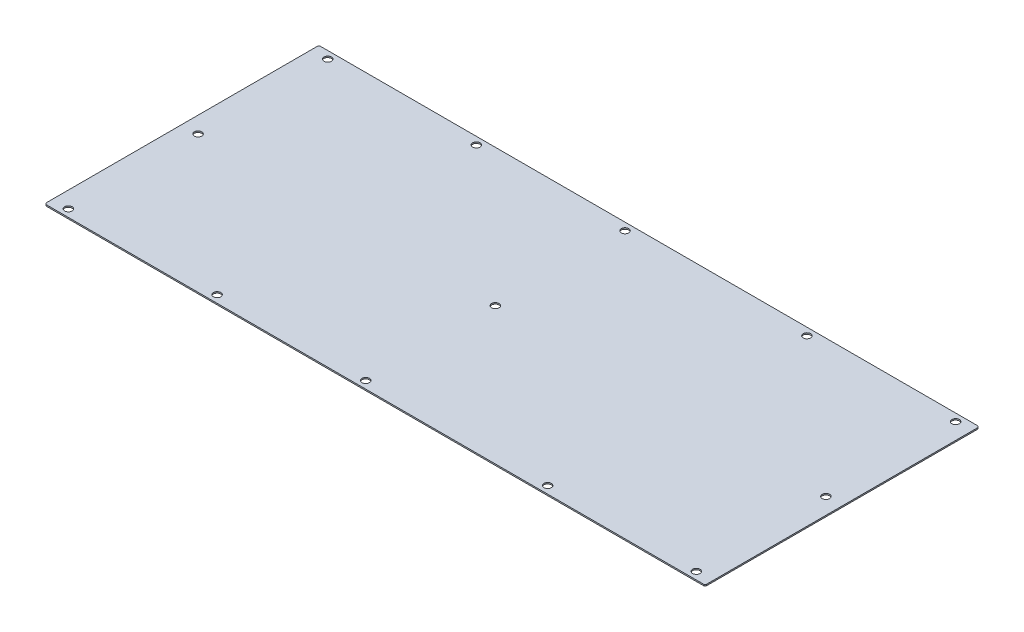
ISO-10303-21;
HEADER;
FILE_DESCRIPTION(('STEP AP214'),'2;1');
FILE_NAME('part.step','',(''),(''),'','','');
FILE_SCHEMA(('AUTOMOTIVE_DESIGN { 1 0 10303 214 1 1 1 1 }'));
ENDSEC;
DATA;
#1=APPLICATION_CONTEXT('core data for automotive mechanical design processes');
#2=APPLICATION_PROTOCOL_DEFINITION('international standard','automotive_design',2000,#1);
#3=PRODUCT_CONTEXT('',#1,'mechanical');
#4=PRODUCT('Part','Part','',(#3));
#5=PRODUCT_RELATED_PRODUCT_CATEGORY('part','',(#4));
#6=PRODUCT_DEFINITION_FORMATION('','',#4);
#7=PRODUCT_DEFINITION_CONTEXT('part definition',#1,'design');
#8=PRODUCT_DEFINITION('design','',#6,#7);
#9=PRODUCT_DEFINITION_SHAPE('','',#8);
#10=(LENGTH_UNIT() NAMED_UNIT(*) SI_UNIT(.MILLI.,.METRE.));
#11=(NAMED_UNIT(*) PLANE_ANGLE_UNIT() SI_UNIT($,.RADIAN.));
#12=(NAMED_UNIT(*) SI_UNIT($,.STERADIAN.) SOLID_ANGLE_UNIT());
#13=UNCERTAINTY_MEASURE_WITH_UNIT(LENGTH_MEASURE(1.E-05),#10,'distance_accuracy_value','');
#14=(GEOMETRIC_REPRESENTATION_CONTEXT(3) GLOBAL_UNCERTAINTY_ASSIGNED_CONTEXT((#13)) GLOBAL_UNIT_ASSIGNED_CONTEXT((#10,
#11,#12)) REPRESENTATION_CONTEXT('',''));
#15=CARTESIAN_POINT('',(0.,0.,0.));
#16=DIRECTION('',(0.,0.,1.));
#17=DIRECTION('',(1.,0.,0.));
#18=AXIS2_PLACEMENT_3D('',#15,#16,#17);
#19=CARTESIAN_POINT('',(0.,-1.,0.));
#20=DIRECTION('',(0.,1.,0.));
#21=DIRECTION('',(0.,0.,1.));
#22=AXIS2_PLACEMENT_3D('',#19,#20,#21);
#23=PLANE('',#22);
#24=DIRECTION('',(0.707106781186548,0.,0.707106781186548));
#25=VECTOR('',#24,1.);
#26=CARTESIAN_POINT('',(243.25,-1.,-100.));
#27=LINE('',#26,#25);
#28=CARTESIAN_POINT('',(242.25,-1.,-101.));
#29=VERTEX_POINT('',#28);
#30=CARTESIAN_POINT('',(243.25,-1.,-100.));
#31=VERTEX_POINT('',#30);
#32=EDGE_CURVE('E80',#29,#31,#27,.T.);
#33=ORIENTED_EDGE('',*,*,#32,.T.);
#34=DIRECTION('',(0.,0.,-1.));
#35=VECTOR('',#34,1.);
#36=CARTESIAN_POINT('',(243.25,-1.,-101.));
#37=LINE('',#36,#35);
#38=CARTESIAN_POINT('',(243.25,-1.,100.));
#39=VERTEX_POINT('',#38);
#40=EDGE_CURVE('E86',#39,#31,#37,.T.);
#41=ORIENTED_EDGE('',*,*,#40,.F.);
#42=DIRECTION('',(0.707106781186538,0.,-0.707106781186557));
#43=VECTOR('',#42,1.);
#44=CARTESIAN_POINT('',(242.25,-1.,101.));
#45=LINE('',#44,#43);
#46=CARTESIAN_POINT('',(242.25,-1.,101.));
#47=VERTEX_POINT('',#46);
#48=EDGE_CURVE('E108',#47,#39,#45,.T.);
#49=ORIENTED_EDGE('',*,*,#48,.F.);
#50=DIRECTION('',(1.,0.,0.));
#51=VECTOR('',#50,1.);
#52=CARTESIAN_POINT('',(-243.25,-1.,101.));
#53=LINE('',#52,#51);
#54=CARTESIAN_POINT('',(-242.25,-1.,101.));
#55=VERTEX_POINT('',#54);
#56=EDGE_CURVE('E504',#55,#47,#53,.T.);
#57=ORIENTED_EDGE('',*,*,#56,.F.);
#58=DIRECTION('',(-0.707106781186548,0.,-0.707106781186548));
#59=VECTOR('',#58,1.);
#60=CARTESIAN_POINT('',(-243.25,-1.,100.));
#61=LINE('',#60,#59);
#62=CARTESIAN_POINT('',(-243.25,-1.,100.));
#63=VERTEX_POINT('',#62);
#64=EDGE_CURVE('E502',#55,#63,#61,.T.);
#65=ORIENTED_EDGE('',*,*,#64,.T.);
#66=DIRECTION('',(0.,0.,1.));
#67=VECTOR('',#66,1.);
#68=CARTESIAN_POINT('',(-243.25,-1.,-101.));
#69=LINE('',#68,#67);
#70=CARTESIAN_POINT('',(-243.25,-1.,-99.9999999999999));
#71=VERTEX_POINT('',#70);
#72=EDGE_CURVE('E489',#71,#63,#69,.T.);
#73=ORIENTED_EDGE('',*,*,#72,.F.);
#74=DIRECTION('',(0.707106781186548,0.,-0.707106781186548));
#75=VECTOR('',#74,1.);
#76=CARTESIAN_POINT('',(-242.25,-1.,-101.));
#77=LINE('',#76,#75);
#78=CARTESIAN_POINT('',(-242.25,-1.,-101.));
#79=VERTEX_POINT('',#78);
#80=EDGE_CURVE('E487',#71,#79,#77,.T.);
#81=ORIENTED_EDGE('',*,*,#80,.T.);
#82=DIRECTION('',(-1.,0.,0.));
#83=VECTOR('',#82,1.);
#84=CARTESIAN_POINT('',(-243.25,-1.,-101.));
#85=LINE('',#84,#83);
#86=EDGE_CURVE('E97',#29,#79,#85,.T.);
#87=ORIENTED_EDGE('',*,*,#86,.F.);
#88=EDGE_LOOP('',(#33,#41,#49,#57,#65,#73,#81,#87));
#89=FACE_BOUND('',#88,.T.);
#90=CARTESIAN_POINT('',(-231.25,-0.999999999999999,-95.5));
#91=DIRECTION('',(0.,1.,0.));
#92=DIRECTION('',(0.,0.,1.));
#93=AXIS2_PLACEMENT_3D('',#90,#91,#92);
#94=CIRCLE('',#93,2.75);
#95=CARTESIAN_POINT('',(-231.25,-0.999999999999999,-92.75));
#96=VERTEX_POINT('',#95);
#97=EDGE_CURVE('E93',#96,#96,#94,.T.);
#98=ORIENTED_EDGE('',*,*,#97,.T.);
#99=EDGE_LOOP('',(#98));
#100=FACE_BOUND('',#99,.T.);
#101=CARTESIAN_POINT('',(-121.75,-0.999999999999999,-95.5));
#102=DIRECTION('',(0.,1.,0.));
#103=DIRECTION('',(0.,0.,1.));
#104=AXIS2_PLACEMENT_3D('',#101,#102,#103);
#105=CIRCLE('',#104,2.75);
#106=CARTESIAN_POINT('',(-121.75,-0.999999999999999,-92.75));
#107=VERTEX_POINT('',#106);
#108=EDGE_CURVE('E152',#107,#107,#105,.T.);
#109=ORIENTED_EDGE('',*,*,#108,.T.);
#110=EDGE_LOOP('',(#109));
#111=FACE_BOUND('',#110,.T.);
#112=CARTESIAN_POINT('',(121.75,-0.999999999999999,-95.5));
#113=DIRECTION('',(0.,1.,0.));
#114=DIRECTION('',(0.,0.,1.));
#115=AXIS2_PLACEMENT_3D('',#112,#113,#114);
#116=CIRCLE('',#115,2.75000000000002);
#117=CARTESIAN_POINT('',(121.75,-0.999999999999999,-92.75));
#118=VERTEX_POINT('',#117);
#119=EDGE_CURVE('E155',#118,#118,#116,.T.);
#120=ORIENTED_EDGE('',*,*,#119,.T.);
#121=EDGE_LOOP('',(#120));
#122=FACE_BOUND('',#121,.T.);
#123=CARTESIAN_POINT('',(-121.75,-0.999999999999999,95.5));
#124=DIRECTION('',(0.,1.,0.));
#125=DIRECTION('',(0.,0.,1.));
#126=AXIS2_PLACEMENT_3D('',#123,#124,#125);
#127=CIRCLE('',#126,2.75);
#128=CARTESIAN_POINT('',(-121.75,-0.999999999999999,98.25));
#129=VERTEX_POINT('',#128);
#130=EDGE_CURVE('E158',#129,#129,#127,.T.);
#131=ORIENTED_EDGE('',*,*,#130,.T.);
#132=EDGE_LOOP('',(#131));
#133=FACE_BOUND('',#132,.T.);
#134=CARTESIAN_POINT('',(231.25,-0.999999999999999,-95.5));
#135=DIRECTION('',(0.,1.,0.));
#136=DIRECTION('',(0.,0.,1.));
#137=AXIS2_PLACEMENT_3D('',#134,#135,#136);
#138=CIRCLE('',#137,2.75);
#139=CARTESIAN_POINT('',(231.25,-0.999999999999999,-92.75));
#140=VERTEX_POINT('',#139);
#141=EDGE_CURVE('E161',#140,#140,#138,.T.);
#142=ORIENTED_EDGE('',*,*,#141,.T.);
#143=EDGE_LOOP('',(#142));
#144=FACE_BOUND('',#143,.T.);
#145=CARTESIAN_POINT('',(231.25,-0.999999999999999,95.5));
#146=DIRECTION('',(0.,1.,0.));
#147=DIRECTION('',(0.,0.,1.));
#148=AXIS2_PLACEMENT_3D('',#145,#146,#147);
#149=CIRCLE('',#148,2.75);
#150=CARTESIAN_POINT('',(231.25,-0.999999999999999,98.25));
#151=VERTEX_POINT('',#150);
#152=EDGE_CURVE('E164',#151,#151,#149,.T.);
#153=ORIENTED_EDGE('',*,*,#152,.T.);
#154=EDGE_LOOP('',(#153));
#155=FACE_BOUND('',#154,.T.);
#156=CARTESIAN_POINT('',(-231.25,-0.999999999999999,95.5));
#157=DIRECTION('',(0.,1.,0.));
#158=DIRECTION('',(0.,0.,1.));
#159=AXIS2_PLACEMENT_3D('',#156,#157,#158);
#160=CIRCLE('',#159,2.75);
#161=CARTESIAN_POINT('',(-231.25,-0.999999999999999,98.25));
#162=VERTEX_POINT('',#161);
#163=EDGE_CURVE('E167',#162,#162,#160,.T.);
#164=ORIENTED_EDGE('',*,*,#163,.T.);
#165=EDGE_LOOP('',(#164));
#166=FACE_BOUND('',#165,.T.);
#167=CARTESIAN_POINT('',(-231.25,-0.999999999999999,0.));
#168=DIRECTION('',(0.,1.,0.));
#169=DIRECTION('',(0.,0.,1.));
#170=AXIS2_PLACEMENT_3D('',#167,#168,#169);
#171=CIRCLE('',#170,2.75000000000001);
#172=CARTESIAN_POINT('',(-231.25,-0.999999999999999,2.75000000000001));
#173=VERTEX_POINT('',#172);
#174=EDGE_CURVE('E170',#173,#173,#171,.T.);
#175=ORIENTED_EDGE('',*,*,#174,.T.);
#176=EDGE_LOOP('',(#175));
#177=FACE_BOUND('',#176,.T.);
#178=CARTESIAN_POINT('',(231.25,-0.999999999999999,0.));
#179=DIRECTION('',(0.,1.,0.));
#180=DIRECTION('',(0.,0.,1.));
#181=AXIS2_PLACEMENT_3D('',#178,#179,#180);
#182=CIRCLE('',#181,2.75000000000001);
#183=CARTESIAN_POINT('',(231.25,-0.999999999999999,2.75000000000001));
#184=VERTEX_POINT('',#183);
#185=EDGE_CURVE('E173',#184,#184,#182,.T.);
#186=ORIENTED_EDGE('',*,*,#185,.T.);
#187=EDGE_LOOP('',(#186));
#188=FACE_BOUND('',#187,.T.);
#189=CARTESIAN_POINT('',(-12.25,-0.999999999999999,95.5));
#190=DIRECTION('',(0.,1.,0.));
#191=DIRECTION('',(0.,0.,1.));
#192=AXIS2_PLACEMENT_3D('',#189,#190,#191);
#193=CIRCLE('',#192,2.75);
#194=CARTESIAN_POINT('',(-12.25,-0.999999999999999,98.25));
#195=VERTEX_POINT('',#194);
#196=EDGE_CURVE('E176',#195,#195,#193,.T.);
#197=ORIENTED_EDGE('',*,*,#196,.T.);
#198=EDGE_LOOP('',(#197));
#199=FACE_BOUND('',#198,.T.);
#200=CARTESIAN_POINT('',(-12.25,-0.999999999999999,0.));
#201=DIRECTION('',(0.,1.,0.));
#202=DIRECTION('',(0.,0.,1.));
#203=AXIS2_PLACEMENT_3D('',#200,#201,#202);
#204=CIRCLE('',#203,2.75);
#205=CARTESIAN_POINT('',(-12.25,-0.999999999999999,2.75));
#206=VERTEX_POINT('',#205);
#207=EDGE_CURVE('E179',#206,#206,#204,.T.);
#208=ORIENTED_EDGE('',*,*,#207,.T.);
#209=EDGE_LOOP('',(#208));
#210=FACE_BOUND('',#209,.T.);
#211=CARTESIAN_POINT('',(-12.25,-0.999999999999999,-95.5));
#212=DIRECTION('',(0.,1.,0.));
#213=DIRECTION('',(0.,0.,1.));
#214=AXIS2_PLACEMENT_3D('',#211,#212,#213);
#215=CIRCLE('',#214,2.75);
#216=CARTESIAN_POINT('',(-12.25,-0.999999999999999,-92.75));
#217=VERTEX_POINT('',#216);
#218=EDGE_CURVE('E181',#217,#217,#215,.T.);
#219=ORIENTED_EDGE('',*,*,#218,.T.);
#220=EDGE_LOOP('',(#219));
#221=FACE_BOUND('',#220,.T.);
#222=CARTESIAN_POINT('',(121.75,-0.999999999999999,95.5));
#223=DIRECTION('',(0.,1.,0.));
#224=DIRECTION('',(0.,0.,1.));
#225=AXIS2_PLACEMENT_3D('',#222,#223,#224);
#226=CIRCLE('',#225,2.75000000000002);
#227=CARTESIAN_POINT('',(121.75,-0.999999999999999,98.25));
#228=VERTEX_POINT('',#227);
#229=EDGE_CURVE('E20',#228,#228,#226,.T.);
#230=ORIENTED_EDGE('',*,*,#229,.T.);
#231=EDGE_LOOP('',(#230));
#232=FACE_BOUND('',#231,.T.);
#233=ADVANCED_FACE('F17',(#89,#100,#111,#122,#133,#144,#155,#166,#177,#188,#199,#210,#221,#232),
#23,.F.);
#234=CARTESIAN_POINT('',(121.75,-10.,95.5));
#235=DIRECTION('',(0.,1.,0.));
#236=DIRECTION('',(0.,0.,1.));
#237=AXIS2_PLACEMENT_3D('',#234,#235,#236);
#238=CYLINDRICAL_SURFACE('',#237,2.75000000000002);
#239=CARTESIAN_POINT('',(121.75,0.,95.5));
#240=DIRECTION('',(0.,1.,0.));
#241=DIRECTION('',(0.,0.,1.));
#242=AXIS2_PLACEMENT_3D('',#239,#240,#241);
#243=CIRCLE('',#242,2.75000000000002);
#244=CARTESIAN_POINT('',(121.75,0.,98.25));
#245=VERTEX_POINT('',#244);
#246=EDGE_CURVE('E147',#245,#245,#243,.F.);
#247=ORIENTED_EDGE('',*,*,#246,.F.);
#248=EDGE_LOOP('',(#247));
#249=FACE_BOUND('',#248,.T.);
#250=ORIENTED_EDGE('',*,*,#229,.F.);
#251=EDGE_LOOP('',(#250));
#252=FACE_BOUND('',#251,.T.);
#253=ADVANCED_FACE('F189',(#249,#252),#238,.F.);
#254=CARTESIAN_POINT('',(-12.25,-10.,-95.5));
#255=DIRECTION('',(0.,1.,0.));
#256=DIRECTION('',(0.,0.,1.));
#257=AXIS2_PLACEMENT_3D('',#254,#255,#256);
#258=CYLINDRICAL_SURFACE('',#257,2.75);
#259=CARTESIAN_POINT('',(-12.25,0.,-95.5));
#260=DIRECTION('',(0.,1.,0.));
#261=DIRECTION('',(0.,0.,1.));
#262=AXIS2_PLACEMENT_3D('',#259,#260,#261);
#263=CIRCLE('',#262,2.75);
#264=CARTESIAN_POINT('',(-12.25,0.,-92.75));
#265=VERTEX_POINT('',#264);
#266=EDGE_CURVE('E144',#265,#265,#263,.F.);
#267=ORIENTED_EDGE('',*,*,#266,.F.);
#268=EDGE_LOOP('',(#267));
#269=FACE_BOUND('',#268,.T.);
#270=ORIENTED_EDGE('',*,*,#218,.F.);
#271=EDGE_LOOP('',(#270));
#272=FACE_BOUND('',#271,.T.);
#273=ADVANCED_FACE('F191',(#269,#272),#258,.F.);
#274=CARTESIAN_POINT('',(-12.25,-10.,0.));
#275=DIRECTION('',(0.,1.,0.));
#276=DIRECTION('',(0.,0.,1.));
#277=AXIS2_PLACEMENT_3D('',#274,#275,#276);
#278=CYLINDRICAL_SURFACE('',#277,2.75);
#279=CARTESIAN_POINT('',(-12.25,0.,0.));
#280=DIRECTION('',(0.,1.,0.));
#281=DIRECTION('',(0.,0.,1.));
#282=AXIS2_PLACEMENT_3D('',#279,#280,#281);
#283=CIRCLE('',#282,2.75);
#284=CARTESIAN_POINT('',(-12.25,0.,2.75));
#285=VERTEX_POINT('',#284);
#286=EDGE_CURVE('E141',#285,#285,#283,.F.);
#287=ORIENTED_EDGE('',*,*,#286,.F.);
#288=EDGE_LOOP('',(#287));
#289=FACE_BOUND('',#288,.T.);
#290=ORIENTED_EDGE('',*,*,#207,.F.);
#291=EDGE_LOOP('',(#290));
#292=FACE_BOUND('',#291,.T.);
#293=ADVANCED_FACE('F198',(#289,#292),#278,.F.);
#294=CARTESIAN_POINT('',(-12.25,-10.,95.5));
#295=DIRECTION('',(0.,1.,0.));
#296=DIRECTION('',(0.,0.,1.));
#297=AXIS2_PLACEMENT_3D('',#294,#295,#296);
#298=CYLINDRICAL_SURFACE('',#297,2.75);
#299=CARTESIAN_POINT('',(-12.25,0.,95.5));
#300=DIRECTION('',(0.,1.,0.));
#301=DIRECTION('',(0.,0.,1.));
#302=AXIS2_PLACEMENT_3D('',#299,#300,#301);
#303=CIRCLE('',#302,2.75);
#304=CARTESIAN_POINT('',(-12.25,0.,98.25));
#305=VERTEX_POINT('',#304);
#306=EDGE_CURVE('E138',#305,#305,#303,.F.);
#307=ORIENTED_EDGE('',*,*,#306,.F.);
#308=EDGE_LOOP('',(#307));
#309=FACE_BOUND('',#308,.T.);
#310=ORIENTED_EDGE('',*,*,#196,.F.);
#311=EDGE_LOOP('',(#310));
#312=FACE_BOUND('',#311,.T.);
#313=ADVANCED_FACE('F273',(#309,#312),#298,.F.);
#314=CARTESIAN_POINT('',(231.25,-10.,0.));
#315=DIRECTION('',(0.,1.,0.));
#316=DIRECTION('',(0.,0.,1.));
#317=AXIS2_PLACEMENT_3D('',#314,#315,#316);
#318=CYLINDRICAL_SURFACE('',#317,2.75000000000001);
#319=CARTESIAN_POINT('',(231.25,0.,0.));
#320=DIRECTION('',(0.,1.,0.));
#321=DIRECTION('',(0.,0.,1.));
#322=AXIS2_PLACEMENT_3D('',#319,#320,#321);
#323=CIRCLE('',#322,2.75000000000001);
#324=CARTESIAN_POINT('',(231.25,0.,2.75000000000001));
#325=VERTEX_POINT('',#324);
#326=EDGE_CURVE('E135',#325,#325,#323,.F.);
#327=ORIENTED_EDGE('',*,*,#326,.F.);
#328=EDGE_LOOP('',(#327));
#329=FACE_BOUND('',#328,.T.);
#330=ORIENTED_EDGE('',*,*,#185,.F.);
#331=EDGE_LOOP('',(#330));
#332=FACE_BOUND('',#331,.T.);
#333=ADVANCED_FACE('F269',(#329,#332),#318,.F.);
#334=CARTESIAN_POINT('',(-231.25,-10.,0.));
#335=DIRECTION('',(0.,1.,0.));
#336=DIRECTION('',(0.,0.,1.));
#337=AXIS2_PLACEMENT_3D('',#334,#335,#336);
#338=CYLINDRICAL_SURFACE('',#337,2.75000000000001);
#339=CARTESIAN_POINT('',(-231.25,0.,0.));
#340=DIRECTION('',(0.,1.,0.));
#341=DIRECTION('',(0.,0.,1.));
#342=AXIS2_PLACEMENT_3D('',#339,#340,#341);
#343=CIRCLE('',#342,2.75000000000001);
#344=CARTESIAN_POINT('',(-231.25,0.,2.75000000000001));
#345=VERTEX_POINT('',#344);
#346=EDGE_CURVE('E132',#345,#345,#343,.F.);
#347=ORIENTED_EDGE('',*,*,#346,.F.);
#348=EDGE_LOOP('',(#347));
#349=FACE_BOUND('',#348,.T.);
#350=ORIENTED_EDGE('',*,*,#174,.F.);
#351=EDGE_LOOP('',(#350));
#352=FACE_BOUND('',#351,.T.);
#353=ADVANCED_FACE('F265',(#349,#352),#338,.F.);
#354=CARTESIAN_POINT('',(-231.25,-10.,95.5));
#355=DIRECTION('',(0.,1.,0.));
#356=DIRECTION('',(0.,0.,1.));
#357=AXIS2_PLACEMENT_3D('',#354,#355,#356);
#358=CYLINDRICAL_SURFACE('',#357,2.75);
#359=CARTESIAN_POINT('',(-231.25,0.,95.5));
#360=DIRECTION('',(0.,1.,0.));
#361=DIRECTION('',(0.,0.,1.));
#362=AXIS2_PLACEMENT_3D('',#359,#360,#361);
#363=CIRCLE('',#362,2.75);
#364=CARTESIAN_POINT('',(-231.25,0.,98.25));
#365=VERTEX_POINT('',#364);
#366=EDGE_CURVE('E129',#365,#365,#363,.F.);
#367=ORIENTED_EDGE('',*,*,#366,.F.);
#368=EDGE_LOOP('',(#367));
#369=FACE_BOUND('',#368,.T.);
#370=ORIENTED_EDGE('',*,*,#163,.F.);
#371=EDGE_LOOP('',(#370));
#372=FACE_BOUND('',#371,.T.);
#373=ADVANCED_FACE('F261',(#369,#372),#358,.F.);
#374=CARTESIAN_POINT('',(231.25,-10.,95.5));
#375=DIRECTION('',(0.,1.,0.));
#376=DIRECTION('',(0.,0.,1.));
#377=AXIS2_PLACEMENT_3D('',#374,#375,#376);
#378=CYLINDRICAL_SURFACE('',#377,2.75);
#379=CARTESIAN_POINT('',(231.25,0.,95.5));
#380=DIRECTION('',(0.,1.,0.));
#381=DIRECTION('',(0.,0.,1.));
#382=AXIS2_PLACEMENT_3D('',#379,#380,#381);
#383=CIRCLE('',#382,2.75);
#384=CARTESIAN_POINT('',(231.25,0.,98.25));
#385=VERTEX_POINT('',#384);
#386=EDGE_CURVE('E126',#385,#385,#383,.F.);
#387=ORIENTED_EDGE('',*,*,#386,.F.);
#388=EDGE_LOOP('',(#387));
#389=FACE_BOUND('',#388,.T.);
#390=ORIENTED_EDGE('',*,*,#152,.F.);
#391=EDGE_LOOP('',(#390));
#392=FACE_BOUND('',#391,.T.);
#393=ADVANCED_FACE('F257',(#389,#392),#378,.F.);
#394=CARTESIAN_POINT('',(231.25,-10.,-95.5));
#395=DIRECTION('',(0.,1.,0.));
#396=DIRECTION('',(0.,0.,1.));
#397=AXIS2_PLACEMENT_3D('',#394,#395,#396);
#398=CYLINDRICAL_SURFACE('',#397,2.75);
#399=CARTESIAN_POINT('',(231.25,0.,-95.5));
#400=DIRECTION('',(0.,1.,0.));
#401=DIRECTION('',(0.,0.,1.));
#402=AXIS2_PLACEMENT_3D('',#399,#400,#401);
#403=CIRCLE('',#402,2.75);
#404=CARTESIAN_POINT('',(231.25,0.,-92.75));
#405=VERTEX_POINT('',#404);
#406=EDGE_CURVE('E123',#405,#405,#403,.F.);
#407=ORIENTED_EDGE('',*,*,#406,.F.);
#408=EDGE_LOOP('',(#407));
#409=FACE_BOUND('',#408,.T.);
#410=ORIENTED_EDGE('',*,*,#141,.F.);
#411=EDGE_LOOP('',(#410));
#412=FACE_BOUND('',#411,.T.);
#413=ADVANCED_FACE('F253',(#409,#412),#398,.F.);
#414=CARTESIAN_POINT('',(-121.75,-10.,95.5));
#415=DIRECTION('',(0.,1.,0.));
#416=DIRECTION('',(0.,0.,1.));
#417=AXIS2_PLACEMENT_3D('',#414,#415,#416);
#418=CYLINDRICAL_SURFACE('',#417,2.75);
#419=CARTESIAN_POINT('',(-121.75,0.,95.5));
#420=DIRECTION('',(0.,1.,0.));
#421=DIRECTION('',(0.,0.,1.));
#422=AXIS2_PLACEMENT_3D('',#419,#420,#421);
#423=CIRCLE('',#422,2.75);
#424=CARTESIAN_POINT('',(-121.75,0.,98.25));
#425=VERTEX_POINT('',#424);
#426=EDGE_CURVE('E120',#425,#425,#423,.F.);
#427=ORIENTED_EDGE('',*,*,#426,.F.);
#428=EDGE_LOOP('',(#427));
#429=FACE_BOUND('',#428,.T.);
#430=ORIENTED_EDGE('',*,*,#130,.F.);
#431=EDGE_LOOP('',(#430));
#432=FACE_BOUND('',#431,.T.);
#433=ADVANCED_FACE('F249',(#429,#432),#418,.F.);
#434=CARTESIAN_POINT('',(121.75,-10.,-95.5));
#435=DIRECTION('',(0.,1.,0.));
#436=DIRECTION('',(0.,0.,1.));
#437=AXIS2_PLACEMENT_3D('',#434,#435,#436);
#438=CYLINDRICAL_SURFACE('',#437,2.75000000000002);
#439=CARTESIAN_POINT('',(121.75,0.,-95.5));
#440=DIRECTION('',(0.,1.,0.));
#441=DIRECTION('',(0.,0.,1.));
#442=AXIS2_PLACEMENT_3D('',#439,#440,#441);
#443=CIRCLE('',#442,2.75000000000002);
#444=CARTESIAN_POINT('',(121.75,0.,-92.75));
#445=VERTEX_POINT('',#444);
#446=EDGE_CURVE('E117',#445,#445,#443,.F.);
#447=ORIENTED_EDGE('',*,*,#446,.F.);
#448=EDGE_LOOP('',(#447));
#449=FACE_BOUND('',#448,.T.);
#450=ORIENTED_EDGE('',*,*,#119,.F.);
#451=EDGE_LOOP('',(#450));
#452=FACE_BOUND('',#451,.T.);
#453=ADVANCED_FACE('F245',(#449,#452),#438,.F.);
#454=CARTESIAN_POINT('',(-121.75,-10.,-95.5));
#455=DIRECTION('',(0.,1.,0.));
#456=DIRECTION('',(0.,0.,1.));
#457=AXIS2_PLACEMENT_3D('',#454,#455,#456);
#458=CYLINDRICAL_SURFACE('',#457,2.75);
#459=CARTESIAN_POINT('',(-121.75,0.,-95.5));
#460=DIRECTION('',(0.,1.,0.));
#461=DIRECTION('',(0.,0.,1.));
#462=AXIS2_PLACEMENT_3D('',#459,#460,#461);
#463=CIRCLE('',#462,2.75);
#464=CARTESIAN_POINT('',(-121.75,0.,-92.75));
#465=VERTEX_POINT('',#464);
#466=EDGE_CURVE('E114',#465,#465,#463,.F.);
#467=ORIENTED_EDGE('',*,*,#466,.F.);
#468=EDGE_LOOP('',(#467));
#469=FACE_BOUND('',#468,.T.);
#470=ORIENTED_EDGE('',*,*,#108,.F.);
#471=EDGE_LOOP('',(#470));
#472=FACE_BOUND('',#471,.T.);
#473=ADVANCED_FACE('F241',(#469,#472),#458,.F.);
#474=CARTESIAN_POINT('',(-231.25,-10.,-95.5));
#475=DIRECTION('',(0.,1.,0.));
#476=DIRECTION('',(0.,0.,1.));
#477=AXIS2_PLACEMENT_3D('',#474,#475,#476);
#478=CYLINDRICAL_SURFACE('',#477,2.75);
#479=CARTESIAN_POINT('',(-231.25,0.,-95.5));
#480=DIRECTION('',(0.,1.,0.));
#481=DIRECTION('',(0.,0.,1.));
#482=AXIS2_PLACEMENT_3D('',#479,#480,#481);
#483=CIRCLE('',#482,2.75);
#484=CARTESIAN_POINT('',(-231.25,0.,-92.75));
#485=VERTEX_POINT('',#484);
#486=EDGE_CURVE('E110',#485,#485,#483,.F.);
#487=ORIENTED_EDGE('',*,*,#486,.F.);
#488=EDGE_LOOP('',(#487));
#489=FACE_BOUND('',#488,.T.);
#490=ORIENTED_EDGE('',*,*,#97,.F.);
#491=EDGE_LOOP('',(#490));
#492=FACE_BOUND('',#491,.T.);
#493=ADVANCED_FACE('F238',(#489,#492),#478,.F.);
#494=CARTESIAN_POINT('',(243.25,-1.,-101.));
#495=DIRECTION('',(1.,0.,0.));
#496=DIRECTION('',(0.,0.,-1.));
#497=AXIS2_PLACEMENT_3D('',#494,#495,#496);
#498=PLANE('',#497);
#499=DIRECTION('',(0.,0.,1.));
#500=VECTOR('',#499,1.);
#501=CARTESIAN_POINT('',(243.25,0.,0.));
#502=LINE('',#501,#500);
#503=CARTESIAN_POINT('',(243.25,0.,100.));
#504=VERTEX_POINT('',#503);
#505=CARTESIAN_POINT('',(243.25,0.,-100.));
#506=VERTEX_POINT('',#505);
#507=EDGE_CURVE('E113',#504,#506,#502,.F.);
#508=ORIENTED_EDGE('',*,*,#507,.F.);
#509=DIRECTION('',(0.,1.,0.));
#510=VECTOR('',#509,1.);
#511=CARTESIAN_POINT('',(243.25,-1.,100.));
#512=LINE('',#511,#510);
#513=EDGE_CURVE('E91',#504,#39,#512,.F.);
#514=ORIENTED_EDGE('',*,*,#513,.T.);
#515=ORIENTED_EDGE('',*,*,#40,.T.);
#516=DIRECTION('',(0.,1.,0.));
#517=VECTOR('',#516,1.);
#518=CARTESIAN_POINT('',(243.25,-1.,-100.));
#519=LINE('',#518,#517);
#520=EDGE_CURVE('E88',#31,#506,#519,.T.);
#521=ORIENTED_EDGE('',*,*,#520,.T.);
#522=EDGE_LOOP('',(#508,#514,#515,#521));
#523=FACE_BOUND('',#522,.T.);
#524=ADVANCED_FACE('F87',(#523),#498,.T.);
#525=CARTESIAN_POINT('',(243.25,-1.,-100.));
#526=DIRECTION('',(-0.707106781186548,0.,0.707106781186548));
#527=DIRECTION('',(0.707106781186548,0.,0.707106781186548));
#528=AXIS2_PLACEMENT_3D('',#525,#526,#527);
#529=PLANE('',#528);
#530=DIRECTION('',(0.,1.,0.));
#531=VECTOR('',#530,1.);
#532=CARTESIAN_POINT('',(242.25,-1.,-101.));
#533=LINE('',#532,#531);
#534=CARTESIAN_POINT('',(242.25,0.,-101.));
#535=VERTEX_POINT('',#534);
#536=EDGE_CURVE('E99',#535,#29,#533,.F.);
#537=ORIENTED_EDGE('',*,*,#536,.F.);
#538=DIRECTION('',(-0.707106781186547,0.,-0.707106781186547));
#539=VECTOR('',#538,1.);
#540=CARTESIAN_POINT('',(243.25,0.,-100.));
#541=LINE('',#540,#539);
#542=EDGE_CURVE('E103',#506,#535,#541,.T.);
#543=ORIENTED_EDGE('',*,*,#542,.F.);
#544=ORIENTED_EDGE('',*,*,#520,.F.);
#545=ORIENTED_EDGE('',*,*,#32,.F.);
#546=EDGE_LOOP('',(#537,#543,#544,#545));
#547=FACE_BOUND('',#546,.T.);
#548=ADVANCED_FACE('F101',(#547),#529,.F.);
#549=CARTESIAN_POINT('',(-243.25,-1.,-101.));
#550=DIRECTION('',(0.,0.,-1.));
#551=DIRECTION('',(-1.,0.,0.));
#552=AXIS2_PLACEMENT_3D('',#549,#550,#551);
#553=PLANE('',#552);
#554=ORIENTED_EDGE('',*,*,#86,.T.);
#555=DIRECTION('',(0.,1.,0.));
#556=VECTOR('',#555,1.);
#557=CARTESIAN_POINT('',(-242.25,-1.,-101.));
#558=LINE('',#557,#556);
#559=CARTESIAN_POINT('',(-242.25,0.,-101.));
#560=VERTEX_POINT('',#559);
#561=EDGE_CURVE('E483',#79,#560,#558,.T.);
#562=ORIENTED_EDGE('',*,*,#561,.T.);
#563=DIRECTION('',(1.,0.,0.));
#564=VECTOR('',#563,1.);
#565=CARTESIAN_POINT('',(0.,0.,-101.));
#566=LINE('',#565,#564);
#567=EDGE_CURVE('E513',#535,#560,#566,.F.);
#568=ORIENTED_EDGE('',*,*,#567,.F.);
#569=ORIENTED_EDGE('',*,*,#536,.T.);
#570=EDGE_LOOP('',(#554,#562,#568,#569));
#571=FACE_BOUND('',#570,.T.);
#572=ADVANCED_FACE('F229',(#571),#553,.T.);
#573=CARTESIAN_POINT('',(-242.25,-1.,-101.));
#574=DIRECTION('',(0.707106781186548,0.,0.707106781186548));
#575=DIRECTION('',(0.707106781186548,0.,-0.707106781186548));
#576=AXIS2_PLACEMENT_3D('',#573,#574,#575);
#577=PLANE('',#576);
#578=DIRECTION('',(0.,1.,0.));
#579=VECTOR('',#578,1.);
#580=CARTESIAN_POINT('',(-243.25,-1.,-99.9999999999999));
#581=LINE('',#580,#579);
#582=CARTESIAN_POINT('',(-243.25,0.,-99.9999999999999));
#583=VERTEX_POINT('',#582);
#584=EDGE_CURVE('E498',#583,#71,#581,.F.);
#585=ORIENTED_EDGE('',*,*,#584,.F.);
#586=DIRECTION('',(-0.707106781186553,0.,0.707106781186543));
#587=VECTOR('',#586,1.);
#588=CARTESIAN_POINT('',(-242.25,0.,-101.));
#589=LINE('',#588,#587);
#590=EDGE_CURVE('E493',#560,#583,#589,.T.);
#591=ORIENTED_EDGE('',*,*,#590,.F.);
#592=ORIENTED_EDGE('',*,*,#561,.F.);
#593=ORIENTED_EDGE('',*,*,#80,.F.);
#594=EDGE_LOOP('',(#585,#591,#592,#593));
#595=FACE_BOUND('',#594,.T.);
#596=ADVANCED_FACE('F225',(#595),#577,.F.);
#597=CARTESIAN_POINT('',(-243.25,-1.,-101.));
#598=DIRECTION('',(-1.,0.,0.));
#599=DIRECTION('',(0.,0.,1.));
#600=AXIS2_PLACEMENT_3D('',#597,#598,#599);
#601=PLANE('',#600);
#602=DIRECTION('',(0.,0.,1.));
#603=VECTOR('',#602,1.);
#604=CARTESIAN_POINT('',(-243.25,0.,0.));
#605=LINE('',#604,#603);
#606=CARTESIAN_POINT('',(-243.25,0.,100.));
#607=VERTEX_POINT('',#606);
#608=EDGE_CURVE('E516',#583,#607,#605,.T.);
#609=ORIENTED_EDGE('',*,*,#608,.F.);
#610=ORIENTED_EDGE('',*,*,#584,.T.);
#611=ORIENTED_EDGE('',*,*,#72,.T.);
#612=DIRECTION('',(0.,1.,0.));
#613=VECTOR('',#612,1.);
#614=CARTESIAN_POINT('',(-243.25,-1.,100.));
#615=LINE('',#614,#613);
#616=EDGE_CURVE('E500',#63,#607,#615,.T.);
#617=ORIENTED_EDGE('',*,*,#616,.T.);
#618=EDGE_LOOP('',(#609,#610,#611,#617));
#619=FACE_BOUND('',#618,.T.);
#620=ADVANCED_FACE('F221',(#619),#601,.T.);
#621=CARTESIAN_POINT('',(-243.25,-1.,100.));
#622=DIRECTION('',(0.707106781186548,0.,-0.707106781186548));
#623=DIRECTION('',(-0.707106781186548,0.,-0.707106781186548));
#624=AXIS2_PLACEMENT_3D('',#621,#622,#623);
#625=PLANE('',#624);
#626=DIRECTION('',(0.,1.,0.));
#627=VECTOR('',#626,1.);
#628=CARTESIAN_POINT('',(-242.25,-1.,101.));
#629=LINE('',#628,#627);
#630=CARTESIAN_POINT('',(-242.25,0.,101.));
#631=VERTEX_POINT('',#630);
#632=EDGE_CURVE('E506',#631,#55,#629,.F.);
#633=ORIENTED_EDGE('',*,*,#632,.F.);
#634=DIRECTION('',(0.707106781186547,0.,0.707106781186547));
#635=VECTOR('',#634,1.);
#636=CARTESIAN_POINT('',(-243.25,0.,100.));
#637=LINE('',#636,#635);
#638=EDGE_CURVE('E519',#607,#631,#637,.T.);
#639=ORIENTED_EDGE('',*,*,#638,.F.);
#640=ORIENTED_EDGE('',*,*,#616,.F.);
#641=ORIENTED_EDGE('',*,*,#64,.F.);
#642=EDGE_LOOP('',(#633,#639,#640,#641));
#643=FACE_BOUND('',#642,.T.);
#644=ADVANCED_FACE('F218',(#643),#625,.F.);
#645=CARTESIAN_POINT('',(-243.25,-1.,101.));
#646=DIRECTION('',(0.,0.,1.));
#647=DIRECTION('',(1.,0.,0.));
#648=AXIS2_PLACEMENT_3D('',#645,#646,#647);
#649=PLANE('',#648);
#650=DIRECTION('',(1.,0.,0.));
#651=VECTOR('',#650,1.);
#652=CARTESIAN_POINT('',(0.,0.,101.));
#653=LINE('',#652,#651);
#654=CARTESIAN_POINT('',(242.25,0.,101.));
#655=VERTEX_POINT('',#654);
#656=EDGE_CURVE('E26',#631,#655,#653,.T.);
#657=ORIENTED_EDGE('',*,*,#656,.F.);
#658=ORIENTED_EDGE('',*,*,#632,.T.);
#659=ORIENTED_EDGE('',*,*,#56,.T.);
#660=DIRECTION('',(0.,1.,0.));
#661=VECTOR('',#660,1.);
#662=CARTESIAN_POINT('',(242.25,-1.,101.));
#663=LINE('',#662,#661);
#664=EDGE_CURVE('E35',#47,#655,#663,.T.);
#665=ORIENTED_EDGE('',*,*,#664,.T.);
#666=EDGE_LOOP('',(#657,#658,#659,#665));
#667=FACE_BOUND('',#666,.T.);
#668=ADVANCED_FACE('F210',(#667),#649,.T.);
#669=CARTESIAN_POINT('',(242.25,-1.,101.));
#670=DIRECTION('',(-0.707106781186557,0.,-0.707106781186538));
#671=DIRECTION('',(-0.707106781186538,0.,0.707106781186557));
#672=AXIS2_PLACEMENT_3D('',#669,#670,#671);
#673=PLANE('',#672);
#674=ORIENTED_EDGE('',*,*,#513,.F.);
#675=DIRECTION('',(0.707106781186538,0.,-0.707106781186557));
#676=VECTOR('',#675,1.);
#677=CARTESIAN_POINT('',(242.25,0.,101.));
#678=LINE('',#677,#676);
#679=EDGE_CURVE('E10',#655,#504,#678,.T.);
#680=ORIENTED_EDGE('',*,*,#679,.F.);
#681=ORIENTED_EDGE('',*,*,#664,.F.);
#682=ORIENTED_EDGE('',*,*,#48,.T.);
#683=EDGE_LOOP('',(#674,#680,#681,#682));
#684=FACE_BOUND('',#683,.T.);
#685=ADVANCED_FACE('F204',(#684),#673,.F.);
#686=CARTESIAN_POINT('',(0.,0.,0.));
#687=DIRECTION('',(0.,1.,0.));
#688=DIRECTION('',(0.,0.,1.));
#689=AXIS2_PLACEMENT_3D('',#686,#687,#688);
#690=PLANE('',#689);
#691=ORIENTED_EDGE('',*,*,#656,.T.);
#692=ORIENTED_EDGE('',*,*,#679,.T.);
#693=ORIENTED_EDGE('',*,*,#507,.T.);
#694=ORIENTED_EDGE('',*,*,#542,.T.);
#695=ORIENTED_EDGE('',*,*,#567,.T.);
#696=ORIENTED_EDGE('',*,*,#590,.T.);
#697=ORIENTED_EDGE('',*,*,#608,.T.);
#698=ORIENTED_EDGE('',*,*,#638,.T.);
#699=EDGE_LOOP('',(#691,#692,#693,#694,#695,#696,#697,#698));
#700=FACE_BOUND('',#699,.T.);
#701=ORIENTED_EDGE('',*,*,#486,.T.);
#702=EDGE_LOOP('',(#701));
#703=FACE_BOUND('',#702,.T.);
#704=ORIENTED_EDGE('',*,*,#466,.T.);
#705=EDGE_LOOP('',(#704));
#706=FACE_BOUND('',#705,.T.);
#707=ORIENTED_EDGE('',*,*,#446,.T.);
#708=EDGE_LOOP('',(#707));
#709=FACE_BOUND('',#708,.T.);
#710=ORIENTED_EDGE('',*,*,#426,.T.);
#711=EDGE_LOOP('',(#710));
#712=FACE_BOUND('',#711,.T.);
#713=ORIENTED_EDGE('',*,*,#406,.T.);
#714=EDGE_LOOP('',(#713));
#715=FACE_BOUND('',#714,.T.);
#716=ORIENTED_EDGE('',*,*,#386,.T.);
#717=EDGE_LOOP('',(#716));
#718=FACE_BOUND('',#717,.T.);
#719=ORIENTED_EDGE('',*,*,#366,.T.);
#720=EDGE_LOOP('',(#719));
#721=FACE_BOUND('',#720,.T.);
#722=ORIENTED_EDGE('',*,*,#346,.T.);
#723=EDGE_LOOP('',(#722));
#724=FACE_BOUND('',#723,.T.);
#725=ORIENTED_EDGE('',*,*,#326,.T.);
#726=EDGE_LOOP('',(#725));
#727=FACE_BOUND('',#726,.T.);
#728=ORIENTED_EDGE('',*,*,#306,.T.);
#729=EDGE_LOOP('',(#728));
#730=FACE_BOUND('',#729,.T.);
#731=ORIENTED_EDGE('',*,*,#286,.T.);
#732=EDGE_LOOP('',(#731));
#733=FACE_BOUND('',#732,.T.);
#734=ORIENTED_EDGE('',*,*,#266,.T.);
#735=EDGE_LOOP('',(#734));
#736=FACE_BOUND('',#735,.T.);
#737=ORIENTED_EDGE('',*,*,#246,.T.);
#738=EDGE_LOOP('',(#737));
#739=FACE_BOUND('',#738,.T.);
#740=ADVANCED_FACE('F202',(#700,#703,#706,#709,#712,#715,#718,#721,#724,#727,#730,#733,#736,
#739),#690,.T.);
#741=CLOSED_SHELL('',(#233,#253,#273,#293,#313,#333,#353,#373,#393,#413,#433,#453,#473,#493,
#524,#548,#572,#596,#620,#644,#668,#685,#740));
#742=MANIFOLD_SOLID_BREP('B1',#741);
#743=ADVANCED_BREP_SHAPE_REPRESENTATION('',(#18,#742),#14);
#744=SHAPE_DEFINITION_REPRESENTATION(#9,#743);
ENDSEC;
END-ISO-10303-21;
